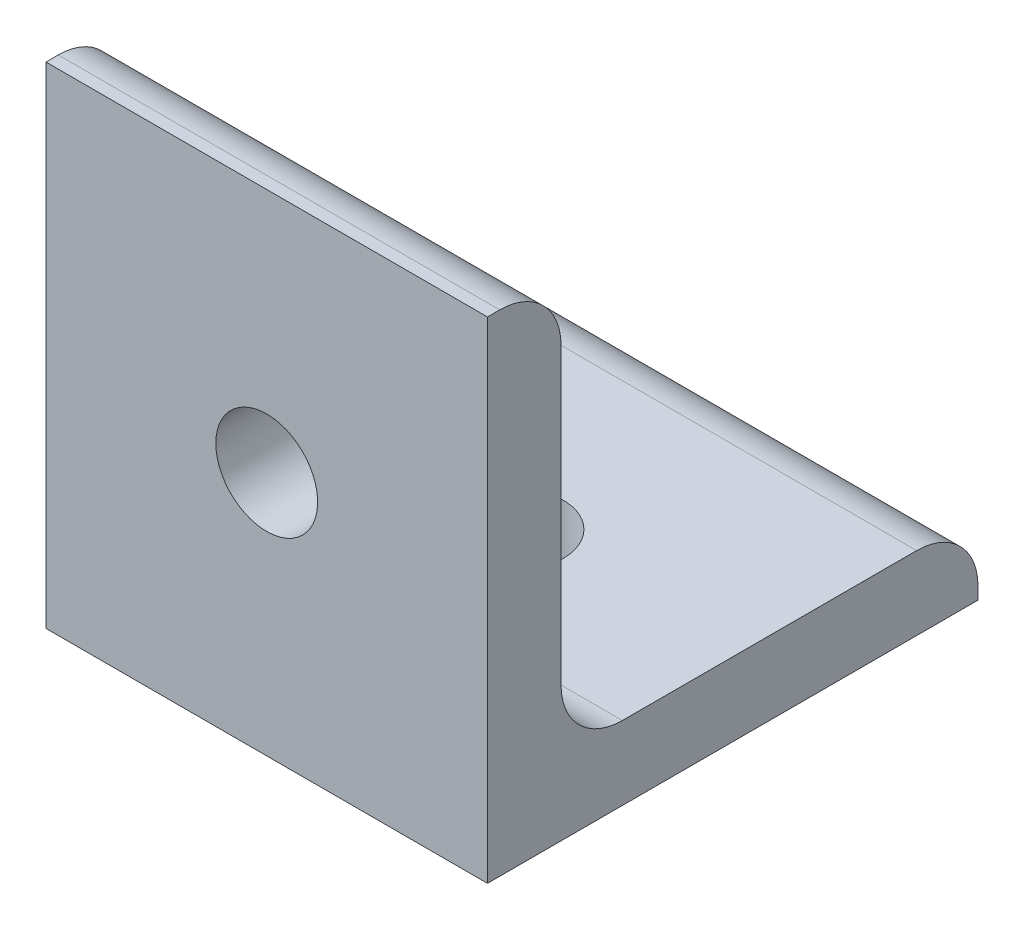
ISO-10303-21;
HEADER;
FILE_DESCRIPTION(('STEP AP214'),'2;1');
FILE_NAME('part.step','',(''),(''),'','','');
FILE_SCHEMA(('AUTOMOTIVE_DESIGN { 1 0 10303 214 1 1 1 1 }'));
ENDSEC;
DATA;
#1=APPLICATION_CONTEXT('core data for automotive mechanical design processes');
#2=APPLICATION_PROTOCOL_DEFINITION('international standard','automotive_design',2000,#1);
#3=PRODUCT_CONTEXT('',#1,'mechanical');
#4=PRODUCT('Part','Part','',(#3));
#5=PRODUCT_RELATED_PRODUCT_CATEGORY('part','',(#4));
#6=PRODUCT_DEFINITION_FORMATION('','',#4);
#7=PRODUCT_DEFINITION_CONTEXT('part definition',#1,'design');
#8=PRODUCT_DEFINITION('design','',#6,#7);
#9=PRODUCT_DEFINITION_SHAPE('','',#8);
#10=(LENGTH_UNIT() NAMED_UNIT(*) SI_UNIT(.MILLI.,.METRE.));
#11=(NAMED_UNIT(*) PLANE_ANGLE_UNIT() SI_UNIT($,.RADIAN.));
#12=(NAMED_UNIT(*) SI_UNIT($,.STERADIAN.) SOLID_ANGLE_UNIT());
#13=UNCERTAINTY_MEASURE_WITH_UNIT(LENGTH_MEASURE(1.E-05),#10,'distance_accuracy_value','');
#14=(GEOMETRIC_REPRESENTATION_CONTEXT(3) GLOBAL_UNCERTAINTY_ASSIGNED_CONTEXT((#13)) GLOBAL_UNIT_ASSIGNED_CONTEXT((#10,
#11,#12)) REPRESENTATION_CONTEXT('',''));
#15=CARTESIAN_POINT('',(0.,0.,0.));
#16=DIRECTION('',(0.,0.,1.));
#17=DIRECTION('',(1.,0.,0.));
#18=AXIS2_PLACEMENT_3D('',#15,#16,#17);
#19=CARTESIAN_POINT('',(18.,40.,0.));
#20=DIRECTION('',(0.,-1.,0.));
#21=DIRECTION('',(0.,0.,-1.));
#22=AXIS2_PLACEMENT_3D('',#19,#20,#21);
#23=PLANE('',#22);
#24=DIRECTION('',(0.,0.,1.));
#25=VECTOR('',#24,1.);
#26=CARTESIAN_POINT('',(18.,40.,0.));
#27=LINE('',#26,#25);
#28=CARTESIAN_POINT('',(18.,40.,-1.));
#29=VERTEX_POINT('',#28);
#30=CARTESIAN_POINT('',(18.,40.,0.));
#31=VERTEX_POINT('',#30);
#32=EDGE_CURVE('E110',#29,#31,#27,.T.);
#33=ORIENTED_EDGE('',*,*,#32,.F.);
#34=DIRECTION('',(-1.,0.,0.));
#35=VECTOR('',#34,1.);
#36=CARTESIAN_POINT('',(18.,40.,-1.));
#37=LINE('',#36,#35);
#38=CARTESIAN_POINT('',(-18.,40.,-1.));
#39=VERTEX_POINT('',#38);
#40=EDGE_CURVE('E151',#29,#39,#37,.T.);
#41=ORIENTED_EDGE('',*,*,#40,.T.);
#42=DIRECTION('',(0.,0.,1.));
#43=VECTOR('',#42,1.);
#44=CARTESIAN_POINT('',(-18.,40.,0.));
#45=LINE('',#44,#43);
#46=CARTESIAN_POINT('',(-18.,40.,0.));
#47=VERTEX_POINT('',#46);
#48=EDGE_CURVE('E134',#39,#47,#45,.T.);
#49=ORIENTED_EDGE('',*,*,#48,.T.);
#50=DIRECTION('',(-1.,0.,0.));
#51=VECTOR('',#50,1.);
#52=CARTESIAN_POINT('',(18.,40.,0.));
#53=LINE('',#52,#51);
#54=EDGE_CURVE('E127',#31,#47,#53,.T.);
#55=ORIENTED_EDGE('',*,*,#54,.F.);
#56=EDGE_LOOP('',(#33,#41,#49,#55));
#57=FACE_BOUND('',#56,.T.);
#58=ADVANCED_FACE('F39',(#57),#23,.F.);
#59=CARTESIAN_POINT('',(18.,40.,0.));
#60=DIRECTION('',(0.,0.,-1.));
#61=DIRECTION('',(-1.,0.,0.));
#62=AXIS2_PLACEMENT_3D('',#59,#60,#61);
#63=PLANE('',#62);
#64=CARTESIAN_POINT('',(0.,20.,0.));
#65=DIRECTION('',(0.,0.,-1.));
#66=DIRECTION('',(-1.,0.,0.));
#67=AXIS2_PLACEMENT_3D('',#64,#65,#66);
#68=CIRCLE('',#67,4.15);
#69=CARTESIAN_POINT('',(-4.15,20.,0.));
#70=VERTEX_POINT('',#69);
#71=EDGE_CURVE('E206',#70,#70,#68,.T.);
#72=ORIENTED_EDGE('',*,*,#71,.T.);
#73=EDGE_LOOP('',(#72));
#74=FACE_BOUND('',#73,.T.);
#75=DIRECTION('',(0.,-1.,0.));
#76=VECTOR('',#75,1.);
#77=CARTESIAN_POINT('',(-18.,40.,0.));
#78=LINE('',#77,#76);
#79=CARTESIAN_POINT('',(-18.,0.,0.));
#80=VERTEX_POINT('',#79);
#81=EDGE_CURVE('E189',#47,#80,#78,.T.);
#82=ORIENTED_EDGE('',*,*,#81,.T.);
#83=DIRECTION('',(-1.,0.,0.));
#84=VECTOR('',#83,1.);
#85=CARTESIAN_POINT('',(18.,0.,0.));
#86=LINE('',#85,#84);
#87=CARTESIAN_POINT('',(18.,0.,0.));
#88=VERTEX_POINT('',#87);
#89=EDGE_CURVE('E129',#88,#80,#86,.T.);
#90=ORIENTED_EDGE('',*,*,#89,.F.);
#91=DIRECTION('',(0.,-1.,0.));
#92=VECTOR('',#91,1.);
#93=CARTESIAN_POINT('',(18.,40.,0.));
#94=LINE('',#93,#92);
#95=EDGE_CURVE('E114',#31,#88,#94,.T.);
#96=ORIENTED_EDGE('',*,*,#95,.F.);
#97=ORIENTED_EDGE('',*,*,#54,.T.);
#98=EDGE_LOOP('',(#82,#90,#96,#97));
#99=FACE_BOUND('',#98,.T.);
#100=ADVANCED_FACE('F126',(#74,#99),#63,.F.);
#101=CARTESIAN_POINT('',(18.,0.,0.));
#102=DIRECTION('',(0.,1.,0.));
#103=DIRECTION('',(0.,0.,1.));
#104=AXIS2_PLACEMENT_3D('',#101,#102,#103);
#105=PLANE('',#104);
#106=CARTESIAN_POINT('',(0.,0.,-20.));
#107=DIRECTION('',(0.,1.,0.));
#108=DIRECTION('',(0.,0.,1.));
#109=AXIS2_PLACEMENT_3D('',#106,#107,#108);
#110=CIRCLE('',#109,4.15);
#111=CARTESIAN_POINT('',(0.,0.,-15.85));
#112=VERTEX_POINT('',#111);
#113=EDGE_CURVE('E190',#112,#112,#110,.T.);
#114=ORIENTED_EDGE('',*,*,#113,.T.);
#115=EDGE_LOOP('',(#114));
#116=FACE_BOUND('',#115,.T.);
#117=DIRECTION('',(0.,0.,-1.));
#118=VECTOR('',#117,1.);
#119=CARTESIAN_POINT('',(-18.,0.,0.));
#120=LINE('',#119,#118);
#121=CARTESIAN_POINT('',(-18.,0.,-40.));
#122=VERTEX_POINT('',#121);
#123=EDGE_CURVE('E192',#80,#122,#120,.T.);
#124=ORIENTED_EDGE('',*,*,#123,.T.);
#125=DIRECTION('',(-1.,0.,0.));
#126=VECTOR('',#125,1.);
#127=CARTESIAN_POINT('',(18.,0.,-40.));
#128=LINE('',#127,#126);
#129=CARTESIAN_POINT('',(18.,0.,-40.));
#130=VERTEX_POINT('',#129);
#131=EDGE_CURVE('E140',#130,#122,#128,.T.);
#132=ORIENTED_EDGE('',*,*,#131,.F.);
#133=DIRECTION('',(0.,0.,-1.));
#134=VECTOR('',#133,1.);
#135=CARTESIAN_POINT('',(18.,0.,0.));
#136=LINE('',#135,#134);
#137=EDGE_CURVE('E131',#88,#130,#136,.T.);
#138=ORIENTED_EDGE('',*,*,#137,.F.);
#139=ORIENTED_EDGE('',*,*,#89,.T.);
#140=EDGE_LOOP('',(#124,#132,#138,#139));
#141=FACE_BOUND('',#140,.T.);
#142=ADVANCED_FACE('F199',(#116,#141),#105,.F.);
#143=CARTESIAN_POINT('',(18.,6.,-40.));
#144=DIRECTION('',(0.,0.,1.));
#145=DIRECTION('',(1.,0.,0.));
#146=AXIS2_PLACEMENT_3D('',#143,#144,#145);
#147=PLANE('',#146);
#148=DIRECTION('',(0.,1.,0.));
#149=VECTOR('',#148,1.);
#150=CARTESIAN_POINT('',(-18.,6.,-40.));
#151=LINE('',#150,#149);
#152=CARTESIAN_POINT('',(-18.,1.,-40.));
#153=VERTEX_POINT('',#152);
#154=EDGE_CURVE('E172',#122,#153,#151,.T.);
#155=ORIENTED_EDGE('',*,*,#154,.T.);
#156=DIRECTION('',(-1.,0.,0.));
#157=VECTOR('',#156,1.);
#158=CARTESIAN_POINT('',(18.,1.,-40.));
#159=LINE('',#158,#157);
#160=CARTESIAN_POINT('',(18.,1.,-40.));
#161=VERTEX_POINT('',#160);
#162=EDGE_CURVE('E54',#153,#161,#159,.F.);
#163=ORIENTED_EDGE('',*,*,#162,.T.);
#164=DIRECTION('',(0.,1.,0.));
#165=VECTOR('',#164,1.);
#166=CARTESIAN_POINT('',(18.,6.,-40.));
#167=LINE('',#166,#165);
#168=EDGE_CURVE('E184',#130,#161,#167,.T.);
#169=ORIENTED_EDGE('',*,*,#168,.F.);
#170=ORIENTED_EDGE('',*,*,#131,.T.);
#171=EDGE_LOOP('',(#155,#163,#169,#170));
#172=FACE_BOUND('',#171,.T.);
#173=ADVANCED_FACE('F230',(#172),#147,.F.);
#174=CARTESIAN_POINT('',(18.,6.,-6.));
#175=DIRECTION('',(0.,-1.,0.));
#176=DIRECTION('',(0.,0.,-1.));
#177=AXIS2_PLACEMENT_3D('',#174,#175,#176);
#178=PLANE('',#177);
#179=CARTESIAN_POINT('',(0.,6.,-20.));
#180=DIRECTION('',(0.,1.,0.));
#181=DIRECTION('',(0.,0.,1.));
#182=AXIS2_PLACEMENT_3D('',#179,#180,#181);
#183=CIRCLE('',#182,4.15);
#184=CARTESIAN_POINT('',(0.,6.,-15.85));
#185=VERTEX_POINT('',#184);
#186=EDGE_CURVE('E203',#185,#185,#183,.T.);
#187=ORIENTED_EDGE('',*,*,#186,.F.);
#188=EDGE_LOOP('',(#187));
#189=FACE_BOUND('',#188,.T.);
#190=DIRECTION('',(0.,0.,1.));
#191=VECTOR('',#190,1.);
#192=CARTESIAN_POINT('',(-18.,6.,-6.));
#193=LINE('',#192,#191);
#194=CARTESIAN_POINT('',(-18.,6.,-35.));
#195=VERTEX_POINT('',#194);
#196=CARTESIAN_POINT('',(-18.,6.,-11.));
#197=VERTEX_POINT('',#196);
#198=EDGE_CURVE('E162',#195,#197,#193,.T.);
#199=ORIENTED_EDGE('',*,*,#198,.T.);
#200=DIRECTION('',(-1.,0.,0.));
#201=VECTOR('',#200,1.);
#202=CARTESIAN_POINT('',(18.,6.,-11.));
#203=LINE('',#202,#201);
#204=CARTESIAN_POINT('',(18.,6.,-11.));
#205=VERTEX_POINT('',#204);
#206=EDGE_CURVE('E149',#197,#205,#203,.F.);
#207=ORIENTED_EDGE('',*,*,#206,.T.);
#208=DIRECTION('',(0.,0.,1.));
#209=VECTOR('',#208,1.);
#210=CARTESIAN_POINT('',(18.,6.,-6.));
#211=LINE('',#210,#209);
#212=CARTESIAN_POINT('',(18.,6.,-35.));
#213=VERTEX_POINT('',#212);
#214=EDGE_CURVE('E178',#213,#205,#211,.T.);
#215=ORIENTED_EDGE('',*,*,#214,.F.);
#216=DIRECTION('',(-1.,0.,0.));
#217=VECTOR('',#216,1.);
#218=CARTESIAN_POINT('',(18.,6.,-35.));
#219=LINE('',#218,#217);
#220=EDGE_CURVE('E146',#213,#195,#219,.T.);
#221=ORIENTED_EDGE('',*,*,#220,.T.);
#222=EDGE_LOOP('',(#199,#207,#215,#221));
#223=FACE_BOUND('',#222,.T.);
#224=ADVANCED_FACE('F168',(#189,#223),#178,.F.);
#225=CARTESIAN_POINT('',(18.,40.,-6.));
#226=DIRECTION('',(0.,0.,1.));
#227=DIRECTION('',(1.,0.,0.));
#228=AXIS2_PLACEMENT_3D('',#225,#226,#227);
#229=PLANE('',#228);
#230=CARTESIAN_POINT('',(0.,20.,-6.));
#231=DIRECTION('',(0.,0.,-1.));
#232=DIRECTION('',(-1.,0.,0.));
#233=AXIS2_PLACEMENT_3D('',#230,#231,#232);
#234=CIRCLE('',#233,4.15);
#235=CARTESIAN_POINT('',(-4.15,20.,-6.));
#236=VERTEX_POINT('',#235);
#237=EDGE_CURVE('E209',#236,#236,#234,.T.);
#238=ORIENTED_EDGE('',*,*,#237,.F.);
#239=EDGE_LOOP('',(#238));
#240=FACE_BOUND('',#239,.T.);
#241=DIRECTION('',(0.,1.,0.));
#242=VECTOR('',#241,1.);
#243=CARTESIAN_POINT('',(18.,40.,-6.));
#244=LINE('',#243,#242);
#245=CARTESIAN_POINT('',(18.,11.,-6.));
#246=VERTEX_POINT('',#245);
#247=CARTESIAN_POINT('',(18.,35.,-6.));
#248=VERTEX_POINT('',#247);
#249=EDGE_CURVE('E177',#246,#248,#244,.T.);
#250=ORIENTED_EDGE('',*,*,#249,.F.);
#251=DIRECTION('',(-1.,0.,0.));
#252=VECTOR('',#251,1.);
#253=CARTESIAN_POINT('',(-18.,11.,-6.));
#254=LINE('',#253,#252);
#255=CARTESIAN_POINT('',(-18.,11.,-6.));
#256=VERTEX_POINT('',#255);
#257=EDGE_CURVE('E138',#246,#256,#254,.T.);
#258=ORIENTED_EDGE('',*,*,#257,.T.);
#259=DIRECTION('',(0.,1.,0.));
#260=VECTOR('',#259,1.);
#261=CARTESIAN_POINT('',(-18.,40.,-6.));
#262=LINE('',#261,#260);
#263=CARTESIAN_POINT('',(-18.,35.,-6.));
#264=VERTEX_POINT('',#263);
#265=EDGE_CURVE('E122',#256,#264,#262,.T.);
#266=ORIENTED_EDGE('',*,*,#265,.T.);
#267=DIRECTION('',(-1.,0.,0.));
#268=VECTOR('',#267,1.);
#269=CARTESIAN_POINT('',(18.,35.,-6.));
#270=LINE('',#269,#268);
#271=EDGE_CURVE('E136',#264,#248,#270,.F.);
#272=ORIENTED_EDGE('',*,*,#271,.T.);
#273=EDGE_LOOP('',(#250,#258,#266,#272));
#274=FACE_BOUND('',#273,.T.);
#275=ADVANCED_FACE('F180',(#240,#274),#229,.F.);
#276=CARTESIAN_POINT('',(18.,0.,0.));
#277=DIRECTION('',(-1.,0.,0.));
#278=DIRECTION('',(0.,0.,1.));
#279=AXIS2_PLACEMENT_3D('',#276,#277,#278);
#280=PLANE('',#279);
#281=ORIENTED_EDGE('',*,*,#249,.T.);
#282=CARTESIAN_POINT('',(18.,35.,-1.));
#283=DIRECTION('',(-1.,0.,0.));
#284=DIRECTION('',(0.,0.,1.));
#285=AXIS2_PLACEMENT_3D('',#282,#283,#284);
#286=CIRCLE('',#285,5.);
#287=EDGE_CURVE('E117',#248,#29,#286,.F.);
#288=ORIENTED_EDGE('',*,*,#287,.T.);
#289=ORIENTED_EDGE('',*,*,#32,.T.);
#290=ORIENTED_EDGE('',*,*,#95,.T.);
#291=ORIENTED_EDGE('',*,*,#137,.T.);
#292=ORIENTED_EDGE('',*,*,#168,.T.);
#293=CARTESIAN_POINT('',(18.,1.,-35.));
#294=DIRECTION('',(-1.,0.,0.));
#295=DIRECTION('',(0.,0.,1.));
#296=AXIS2_PLACEMENT_3D('',#293,#294,#295);
#297=CIRCLE('',#296,5.);
#298=EDGE_CURVE('E156',#161,#213,#297,.F.);
#299=ORIENTED_EDGE('',*,*,#298,.T.);
#300=ORIENTED_EDGE('',*,*,#214,.T.);
#301=CARTESIAN_POINT('',(18.,11.,-11.));
#302=DIRECTION('',(-1.,0.,0.));
#303=DIRECTION('',(0.,0.,1.));
#304=AXIS2_PLACEMENT_3D('',#301,#302,#303);
#305=CIRCLE('',#304,5.);
#306=EDGE_CURVE('E11',#205,#246,#305,.T.);
#307=ORIENTED_EDGE('',*,*,#306,.T.);
#308=EDGE_LOOP('',(#281,#288,#289,#290,#291,#292,#299,#300,#307));
#309=FACE_BOUND('',#308,.T.);
#310=ADVANCED_FACE('F113',(#309),#280,.F.);
#311=CARTESIAN_POINT('',(-18.,0.,0.));
#312=DIRECTION('',(-1.,0.,0.));
#313=DIRECTION('',(0.,0.,1.));
#314=AXIS2_PLACEMENT_3D('',#311,#312,#313);
#315=PLANE('',#314);
#316=ORIENTED_EDGE('',*,*,#48,.F.);
#317=CARTESIAN_POINT('',(-18.,35.,-1.));
#318=DIRECTION('',(-1.,0.,0.));
#319=DIRECTION('',(0.,0.,1.));
#320=AXIS2_PLACEMENT_3D('',#317,#318,#319);
#321=CIRCLE('',#320,5.);
#322=EDGE_CURVE('E154',#39,#264,#321,.T.);
#323=ORIENTED_EDGE('',*,*,#322,.T.);
#324=ORIENTED_EDGE('',*,*,#265,.F.);
#325=CARTESIAN_POINT('',(-18.,11.,-11.));
#326=DIRECTION('',(-1.,0.,0.));
#327=DIRECTION('',(0.,0.,1.));
#328=AXIS2_PLACEMENT_3D('',#325,#326,#327);
#329=CIRCLE('',#328,5.);
#330=EDGE_CURVE('E47',#256,#197,#329,.F.);
#331=ORIENTED_EDGE('',*,*,#330,.T.);
#332=ORIENTED_EDGE('',*,*,#198,.F.);
#333=CARTESIAN_POINT('',(-18.,1.,-35.));
#334=DIRECTION('',(-1.,0.,0.));
#335=DIRECTION('',(0.,0.,1.));
#336=AXIS2_PLACEMENT_3D('',#333,#334,#335);
#337=CIRCLE('',#336,5.);
#338=EDGE_CURVE('E62',#195,#153,#337,.T.);
#339=ORIENTED_EDGE('',*,*,#338,.T.);
#340=ORIENTED_EDGE('',*,*,#154,.F.);
#341=ORIENTED_EDGE('',*,*,#123,.F.);
#342=ORIENTED_EDGE('',*,*,#81,.F.);
#343=EDGE_LOOP('',(#316,#323,#324,#331,#332,#339,#340,#341,#342));
#344=FACE_BOUND('',#343,.T.);
#345=ADVANCED_FACE('F161',(#344),#315,.T.);
#346=CARTESIAN_POINT('',(0.,0.,-20.));
#347=DIRECTION('',(0.,1.,0.));
#348=DIRECTION('',(0.,0.,1.));
#349=AXIS2_PLACEMENT_3D('',#346,#347,#348);
#350=CYLINDRICAL_SURFACE('',#349,4.15);
#351=ORIENTED_EDGE('',*,*,#113,.F.);
#352=EDGE_LOOP('',(#351));
#353=FACE_BOUND('',#352,.T.);
#354=ORIENTED_EDGE('',*,*,#186,.T.);
#355=EDGE_LOOP('',(#354));
#356=FACE_BOUND('',#355,.T.);
#357=ADVANCED_FACE('F219',(#353,#356),#350,.F.);
#358=CARTESIAN_POINT('',(0.,20.,0.));
#359=DIRECTION('',(0.,0.,-1.));
#360=DIRECTION('',(-1.,0.,0.));
#361=AXIS2_PLACEMENT_3D('',#358,#359,#360);
#362=CYLINDRICAL_SURFACE('',#361,4.15);
#363=ORIENTED_EDGE('',*,*,#71,.F.);
#364=EDGE_LOOP('',(#363));
#365=FACE_BOUND('',#364,.T.);
#366=ORIENTED_EDGE('',*,*,#237,.T.);
#367=EDGE_LOOP('',(#366));
#368=FACE_BOUND('',#367,.T.);
#369=ADVANCED_FACE('F216',(#365,#368),#362,.F.);
#370=CARTESIAN_POINT('',(18.,11.,-11.));
#371=DIRECTION('',(1.,0.,0.));
#372=DIRECTION('',(0.,0.,-1.));
#373=AXIS2_PLACEMENT_3D('',#370,#371,#372);
#374=CYLINDRICAL_SURFACE('',#373,5.);
#375=ORIENTED_EDGE('',*,*,#306,.F.);
#376=ORIENTED_EDGE('',*,*,#206,.F.);
#377=ORIENTED_EDGE('',*,*,#330,.F.);
#378=ORIENTED_EDGE('',*,*,#257,.F.);
#379=EDGE_LOOP('',(#375,#376,#377,#378));
#380=FACE_BOUND('',#379,.T.);
#381=ADVANCED_FACE('F175',(#380),#374,.F.);
#382=CARTESIAN_POINT('',(18.,35.,-1.));
#383=DIRECTION('',(-1.,0.,0.));
#384=DIRECTION('',(0.,0.,1.));
#385=AXIS2_PLACEMENT_3D('',#382,#383,#384);
#386=CYLINDRICAL_SURFACE('',#385,5.);
#387=ORIENTED_EDGE('',*,*,#287,.F.);
#388=ORIENTED_EDGE('',*,*,#271,.F.);
#389=ORIENTED_EDGE('',*,*,#322,.F.);
#390=ORIENTED_EDGE('',*,*,#40,.F.);
#391=EDGE_LOOP('',(#387,#388,#389,#390));
#392=FACE_BOUND('',#391,.T.);
#393=ADVANCED_FACE('F196',(#392),#386,.T.);
#394=CARTESIAN_POINT('',(18.,1.,-35.));
#395=DIRECTION('',(-1.,0.,0.));
#396=DIRECTION('',(0.,0.,1.));
#397=AXIS2_PLACEMENT_3D('',#394,#395,#396);
#398=CYLINDRICAL_SURFACE('',#397,5.);
#399=ORIENTED_EDGE('',*,*,#298,.F.);
#400=ORIENTED_EDGE('',*,*,#162,.F.);
#401=ORIENTED_EDGE('',*,*,#338,.F.);
#402=ORIENTED_EDGE('',*,*,#220,.F.);
#403=EDGE_LOOP('',(#399,#400,#401,#402));
#404=FACE_BOUND('',#403,.T.);
#405=ADVANCED_FACE('F41',(#404),#398,.T.);
#406=CLOSED_SHELL('',(#58,#100,#142,#173,#224,#275,#310,#345,#357,#369,#381,#393,#405));
#407=MANIFOLD_SOLID_BREP('B2',#406);
#408=ADVANCED_BREP_SHAPE_REPRESENTATION('',(#18,#407),#14);
#409=SHAPE_DEFINITION_REPRESENTATION(#9,#408);
ENDSEC;
END-ISO-10303-21;
